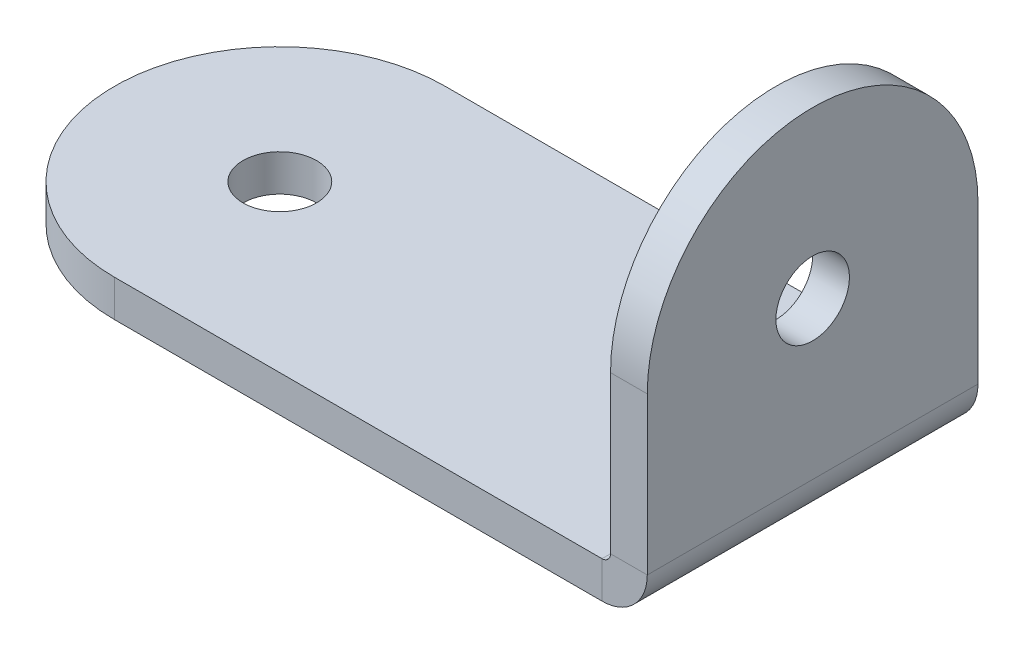
ISO-10303-21;
HEADER;
FILE_DESCRIPTION(('STEP AP214'),'2;1');
FILE_NAME('part.step','',(''),(''),'','','');
FILE_SCHEMA(('AUTOMOTIVE_DESIGN { 1 0 10303 214 1 1 1 1 }'));
ENDSEC;
DATA;
#1=APPLICATION_CONTEXT('core data for automotive mechanical design processes');
#2=APPLICATION_PROTOCOL_DEFINITION('international standard','automotive_design',2000,#1);
#3=PRODUCT_CONTEXT('',#1,'mechanical');
#4=PRODUCT('Part','Part','',(#3));
#5=PRODUCT_RELATED_PRODUCT_CATEGORY('part','',(#4));
#6=PRODUCT_DEFINITION_FORMATION('','',#4);
#7=PRODUCT_DEFINITION_CONTEXT('part definition',#1,'design');
#8=PRODUCT_DEFINITION('design','',#6,#7);
#9=PRODUCT_DEFINITION_SHAPE('','',#8);
#10=(LENGTH_UNIT() NAMED_UNIT(*) SI_UNIT(.MILLI.,.METRE.));
#11=(NAMED_UNIT(*) PLANE_ANGLE_UNIT() SI_UNIT($,.RADIAN.));
#12=(NAMED_UNIT(*) SI_UNIT($,.STERADIAN.) SOLID_ANGLE_UNIT());
#13=UNCERTAINTY_MEASURE_WITH_UNIT(LENGTH_MEASURE(1.E-05),#10,'distance_accuracy_value','');
#14=(GEOMETRIC_REPRESENTATION_CONTEXT(3) GLOBAL_UNCERTAINTY_ASSIGNED_CONTEXT((#13)) GLOBAL_UNIT_ASSIGNED_CONTEXT((#10,
#11,#12)) REPRESENTATION_CONTEXT('',''));
#15=CARTESIAN_POINT('',(0.,0.,0.));
#16=DIRECTION('',(0.,0.,1.));
#17=DIRECTION('',(1.,0.,0.));
#18=AXIS2_PLACEMENT_3D('',#15,#16,#17);
#19=CARTESIAN_POINT('',(3.175,14.2875,0.));
#20=DIRECTION('',(1.,0.,0.));
#21=DIRECTION('',(0.,0.,-1.));
#22=AXIS2_PLACEMENT_3D('',#19,#20,#21);
#23=CYLINDRICAL_SURFACE('',#22,14.2875);
#24=DIRECTION('',(1.,0.,0.));
#25=VECTOR('',#24,1.);
#26=CARTESIAN_POINT('',(-0.736599999999999,14.2875,14.2875));
#27=LINE('',#26,#25);
#28=CARTESIAN_POINT('',(3.175,14.2875,14.2875));
#29=VERTEX_POINT('',#28);
#30=CARTESIAN_POINT('',(0.,14.2875,14.2875));
#31=VERTEX_POINT('',#30);
#32=EDGE_CURVE('E182',#29,#31,#27,.F.);
#33=ORIENTED_EDGE('',*,*,#32,.F.);
#34=CARTESIAN_POINT('',(3.175,14.2875,0.));
#35=DIRECTION('',(1.,0.,0.));
#36=DIRECTION('',(0.,0.,-1.));
#37=AXIS2_PLACEMENT_3D('',#34,#35,#36);
#38=CIRCLE('',#37,14.2875);
#39=CARTESIAN_POINT('',(3.175,14.2875,-14.2875));
#40=VERTEX_POINT('',#39);
#41=EDGE_CURVE('E47',#40,#29,#38,.T.);
#42=ORIENTED_EDGE('',*,*,#41,.F.);
#43=DIRECTION('',(-1.,0.,0.));
#44=VECTOR('',#43,1.);
#45=CARTESIAN_POINT('',(3.175,14.2875,-14.2875));
#46=LINE('',#45,#44);
#47=CARTESIAN_POINT('',(0.,14.2875,-14.2875));
#48=VERTEX_POINT('',#47);
#49=EDGE_CURVE('E185',#48,#40,#46,.F.);
#50=ORIENTED_EDGE('',*,*,#49,.F.);
#51=CARTESIAN_POINT('',(0.,14.2875,0.));
#52=DIRECTION('',(1.,0.,0.));
#53=DIRECTION('',(0.,0.,-1.));
#54=AXIS2_PLACEMENT_3D('',#51,#52,#53);
#55=CIRCLE('',#54,14.2875);
#56=EDGE_CURVE('E11',#31,#48,#55,.F.);
#57=ORIENTED_EDGE('',*,*,#56,.F.);
#58=EDGE_LOOP('',(#33,#42,#50,#57));
#59=FACE_BOUND('',#58,.T.);
#60=ADVANCED_FACE('F39',(#59),#23,.T.);
#61=CARTESIAN_POINT('',(-42.8625,0.,0.));
#62=DIRECTION('',(0.,1.,0.));
#63=DIRECTION('',(0.,0.,1.));
#64=AXIS2_PLACEMENT_3D('',#61,#62,#63);
#65=CYLINDRICAL_SURFACE('',#64,14.2875);
#66=DIRECTION('',(0.,1.,0.));
#67=VECTOR('',#66,1.);
#68=CARTESIAN_POINT('',(-42.8625,0.7366,14.2875));
#69=LINE('',#68,#67);
#70=CARTESIAN_POINT('',(-42.8625,0.,14.2875));
#71=VERTEX_POINT('',#70);
#72=CARTESIAN_POINT('',(-42.8625,-3.17500000000001,14.2875));
#73=VERTEX_POINT('',#72);
#74=EDGE_CURVE('E134',#71,#73,#69,.F.);
#75=ORIENTED_EDGE('',*,*,#74,.F.);
#76=CARTESIAN_POINT('',(-42.8625,0.,0.));
#77=DIRECTION('',(0.,-1.,0.));
#78=DIRECTION('',(1.,0.,0.));
#79=AXIS2_PLACEMENT_3D('',#76,#77,#78);
#80=CIRCLE('',#79,14.2875);
#81=CARTESIAN_POINT('',(-42.8625,0.,-14.2875));
#82=VERTEX_POINT('',#81);
#83=EDGE_CURVE('E178',#82,#71,#80,.F.);
#84=ORIENTED_EDGE('',*,*,#83,.F.);
#85=DIRECTION('',(0.,1.,0.));
#86=VECTOR('',#85,1.);
#87=CARTESIAN_POINT('',(-42.8625,0.736600000000001,-14.2875));
#88=LINE('',#87,#86);
#89=CARTESIAN_POINT('',(-42.8625,-3.17500000000001,-14.2875));
#90=VERTEX_POINT('',#89);
#91=EDGE_CURVE('E175',#90,#82,#88,.T.);
#92=ORIENTED_EDGE('',*,*,#91,.F.);
#93=CARTESIAN_POINT('',(-42.8625,-3.17500000000001,0.));
#94=DIRECTION('',(0.,-1.,0.));
#95=DIRECTION('',(1.,0.,0.));
#96=AXIS2_PLACEMENT_3D('',#93,#94,#95);
#97=CIRCLE('',#96,14.2875);
#98=EDGE_CURVE('E180',#73,#90,#97,.T.);
#99=ORIENTED_EDGE('',*,*,#98,.F.);
#100=EDGE_LOOP('',(#75,#84,#92,#99));
#101=FACE_BOUND('',#100,.T.);
#102=ADVANCED_FACE('F232',(#101),#65,.T.);
#103=CARTESIAN_POINT('',(0.,0.7366,14.2875));
#104=DIRECTION('',(0.,0.,1.));
#105=DIRECTION('',(1.,0.,0.));
#106=AXIS2_PLACEMENT_3D('',#103,#104,#105);
#107=PLANE('',#106);
#108=DIRECTION('',(1.,0.,0.));
#109=VECTOR('',#108,1.);
#110=CARTESIAN_POINT('',(0.,0.7366,14.2875));
#111=LINE('',#110,#109);
#112=CARTESIAN_POINT('',(0.,0.7366,14.2875));
#113=VERTEX_POINT('',#112);
#114=CARTESIAN_POINT('',(3.175,0.736600000000001,14.2875));
#115=VERTEX_POINT('',#114);
#116=EDGE_CURVE('E113',#113,#115,#111,.T.);
#117=ORIENTED_EDGE('',*,*,#116,.F.);
#118=CARTESIAN_POINT('',(-0.7366,0.7366,14.2875));
#119=DIRECTION('',(0.,0.,1.));
#120=DIRECTION('',(1.,0.,0.));
#121=AXIS2_PLACEMENT_3D('',#118,#119,#120);
#122=CIRCLE('',#121,0.7366);
#123=CARTESIAN_POINT('',(-0.7366,0.,14.2875));
#124=VERTEX_POINT('',#123);
#125=EDGE_CURVE('E108',#113,#124,#122,.F.);
#126=ORIENTED_EDGE('',*,*,#125,.T.);
#127=DIRECTION('',(0.,1.,0.));
#128=VECTOR('',#127,1.);
#129=CARTESIAN_POINT('',(-0.736599999999999,-3.175,14.2875));
#130=LINE('',#129,#128);
#131=CARTESIAN_POINT('',(-0.736599999999999,-3.175,14.2875));
#132=VERTEX_POINT('',#131);
#133=EDGE_CURVE('E101',#132,#124,#130,.T.);
#134=ORIENTED_EDGE('',*,*,#133,.F.);
#135=CARTESIAN_POINT('',(-0.7366,0.7366,14.2875));
#136=DIRECTION('',(0.,0.,1.));
#137=DIRECTION('',(1.,0.,0.));
#138=AXIS2_PLACEMENT_3D('',#135,#136,#137);
#139=CIRCLE('',#138,3.9116);
#140=EDGE_CURVE('E106',#115,#132,#139,.F.);
#141=ORIENTED_EDGE('',*,*,#140,.F.);
#142=EDGE_LOOP('',(#117,#126,#134,#141));
#143=FACE_BOUND('',#142,.T.);
#144=ADVANCED_FACE('F104',(#143),#107,.T.);
#145=CARTESIAN_POINT('',(-0.736599999999999,-3.175,14.2875));
#146=DIRECTION('',(0.,0.,1.));
#147=DIRECTION('',(1.,0.,0.));
#148=AXIS2_PLACEMENT_3D('',#145,#146,#147);
#149=PLANE('',#148);
#150=DIRECTION('',(0.,1.,0.));
#151=VECTOR('',#150,1.);
#152=CARTESIAN_POINT('',(3.175,28.575,14.2875));
#153=LINE('',#152,#151);
#154=EDGE_CURVE('E140',#29,#115,#153,.F.);
#155=ORIENTED_EDGE('',*,*,#154,.F.);
#156=ORIENTED_EDGE('',*,*,#32,.T.);
#157=DIRECTION('',(0.,-1.,0.));
#158=VECTOR('',#157,1.);
#159=CARTESIAN_POINT('',(0.,28.575,14.2875));
#160=LINE('',#159,#158);
#161=EDGE_CURVE('E142',#31,#113,#160,.T.);
#162=ORIENTED_EDGE('',*,*,#161,.T.);
#163=ORIENTED_EDGE('',*,*,#116,.T.);
#164=EDGE_LOOP('',(#155,#156,#162,#163));
#165=FACE_BOUND('',#164,.T.);
#166=ADVANCED_FACE('F191',(#165),#149,.T.);
#167=CARTESIAN_POINT('',(-0.7366,0.,-14.2875));
#168=DIRECTION('',(0.,0.,-1.));
#169=DIRECTION('',(-1.,0.,0.));
#170=AXIS2_PLACEMENT_3D('',#167,#168,#169);
#171=PLANE('',#170);
#172=DIRECTION('',(0.,-1.,0.));
#173=VECTOR('',#172,1.);
#174=CARTESIAN_POINT('',(-0.7366,0.,-14.2875));
#175=LINE('',#174,#173);
#176=CARTESIAN_POINT('',(-0.7366,0.,-14.2875));
#177=VERTEX_POINT('',#176);
#178=CARTESIAN_POINT('',(-0.736599999999999,-3.175,-14.2875));
#179=VERTEX_POINT('',#178);
#180=EDGE_CURVE('E114',#177,#179,#175,.T.);
#181=ORIENTED_EDGE('',*,*,#180,.F.);
#182=CARTESIAN_POINT('',(-0.7366,0.7366,-14.2875));
#183=DIRECTION('',(0.,0.,1.));
#184=DIRECTION('',(1.,0.,0.));
#185=AXIS2_PLACEMENT_3D('',#182,#183,#184);
#186=CIRCLE('',#185,0.7366);
#187=CARTESIAN_POINT('',(0.,0.7366,-14.2875));
#188=VERTEX_POINT('',#187);
#189=EDGE_CURVE('E160',#188,#177,#186,.F.);
#190=ORIENTED_EDGE('',*,*,#189,.F.);
#191=DIRECTION('',(-1.,0.,0.));
#192=VECTOR('',#191,1.);
#193=CARTESIAN_POINT('',(3.175,0.736600000000001,-14.2875));
#194=LINE('',#193,#192);
#195=CARTESIAN_POINT('',(3.175,0.736600000000001,-14.2875));
#196=VERTEX_POINT('',#195);
#197=EDGE_CURVE('E128',#196,#188,#194,.T.);
#198=ORIENTED_EDGE('',*,*,#197,.F.);
#199=CARTESIAN_POINT('',(-0.7366,0.7366,-14.2875));
#200=DIRECTION('',(0.,0.,1.));
#201=DIRECTION('',(1.,0.,0.));
#202=AXIS2_PLACEMENT_3D('',#199,#200,#201);
#203=CIRCLE('',#202,3.9116);
#204=EDGE_CURVE('E154',#196,#179,#203,.F.);
#205=ORIENTED_EDGE('',*,*,#204,.T.);
#206=EDGE_LOOP('',(#181,#190,#198,#205));
#207=FACE_BOUND('',#206,.T.);
#208=ADVANCED_FACE('F247',(#207),#171,.T.);
#209=CARTESIAN_POINT('',(3.175,0.736600000000001,-14.2875));
#210=DIRECTION('',(0.,0.,-1.));
#211=DIRECTION('',(-1.,0.,0.));
#212=AXIS2_PLACEMENT_3D('',#209,#210,#211);
#213=PLANE('',#212);
#214=DIRECTION('',(-1.,0.,0.));
#215=VECTOR('',#214,1.);
#216=CARTESIAN_POINT('',(0.,-3.175,-14.2875));
#217=LINE('',#216,#215);
#218=EDGE_CURVE('E124',#179,#90,#217,.T.);
#219=ORIENTED_EDGE('',*,*,#218,.T.);
#220=ORIENTED_EDGE('',*,*,#91,.T.);
#221=DIRECTION('',(-1.,0.,0.));
#222=VECTOR('',#221,1.);
#223=CARTESIAN_POINT('',(0.,0.,-14.2875));
#224=LINE('',#223,#222);
#225=EDGE_CURVE('E149',#177,#82,#224,.T.);
#226=ORIENTED_EDGE('',*,*,#225,.F.);
#227=ORIENTED_EDGE('',*,*,#180,.T.);
#228=EDGE_LOOP('',(#219,#220,#226,#227));
#229=FACE_BOUND('',#228,.T.);
#230=ADVANCED_FACE('F250',(#229),#213,.T.);
#231=CARTESIAN_POINT('',(0.,0.,14.2875));
#232=DIRECTION('',(0.,-1.,0.));
#233=DIRECTION('',(1.,0.,0.));
#234=AXIS2_PLACEMENT_3D('',#231,#232,#233);
#235=PLANE('',#234);
#236=CARTESIAN_POINT('',(-42.8625,0.,0.));
#237=DIRECTION('',(0.,1.,0.));
#238=DIRECTION('',(-1.,0.,0.));
#239=AXIS2_PLACEMENT_3D('',#236,#237,#238);
#240=CIRCLE('',#239,3.175);
#241=CARTESIAN_POINT('',(-46.0375,0.,0.));
#242=VERTEX_POINT('',#241);
#243=EDGE_CURVE('E203',#242,#242,#240,.T.);
#244=ORIENTED_EDGE('',*,*,#243,.F.);
#245=EDGE_LOOP('',(#244));
#246=FACE_BOUND('',#245,.T.);
#247=ORIENTED_EDGE('',*,*,#225,.T.);
#248=ORIENTED_EDGE('',*,*,#83,.T.);
#249=DIRECTION('',(-1.,0.,0.));
#250=VECTOR('',#249,1.);
#251=CARTESIAN_POINT('',(0.,0.,14.2875));
#252=LINE('',#251,#250);
#253=EDGE_CURVE('E135',#124,#71,#252,.T.);
#254=ORIENTED_EDGE('',*,*,#253,.F.);
#255=DIRECTION('',(0.,0.,-1.));
#256=VECTOR('',#255,1.);
#257=CARTESIAN_POINT('',(-0.7366,0.,14.2875));
#258=LINE('',#257,#256);
#259=EDGE_CURVE('E148',#124,#177,#258,.T.);
#260=ORIENTED_EDGE('',*,*,#259,.T.);
#261=EDGE_LOOP('',(#247,#248,#254,#260));
#262=FACE_BOUND('',#261,.T.);
#263=ADVANCED_FACE('F201',(#246,#262),#235,.F.);
#264=CARTESIAN_POINT('',(0.,-3.175,14.2875));
#265=DIRECTION('',(0.,-1.,0.));
#266=DIRECTION('',(1.,0.,0.));
#267=AXIS2_PLACEMENT_3D('',#264,#265,#266);
#268=PLANE('',#267);
#269=CARTESIAN_POINT('',(-42.8625,-3.17500000000001,0.));
#270=DIRECTION('',(0.,1.,0.));
#271=DIRECTION('',(-1.,0.,0.));
#272=AXIS2_PLACEMENT_3D('',#269,#270,#271);
#273=CIRCLE('',#272,3.175);
#274=CARTESIAN_POINT('',(-46.0375,-3.17500000000001,0.));
#275=VERTEX_POINT('',#274);
#276=EDGE_CURVE('E152',#275,#275,#273,.T.);
#277=ORIENTED_EDGE('',*,*,#276,.T.);
#278=EDGE_LOOP('',(#277));
#279=FACE_BOUND('',#278,.T.);
#280=DIRECTION('',(-1.,0.,0.));
#281=VECTOR('',#280,1.);
#282=CARTESIAN_POINT('',(0.,-3.175,14.2875));
#283=LINE('',#282,#281);
#284=EDGE_CURVE('E122',#132,#73,#283,.T.);
#285=ORIENTED_EDGE('',*,*,#284,.T.);
#286=ORIENTED_EDGE('',*,*,#98,.T.);
#287=ORIENTED_EDGE('',*,*,#218,.F.);
#288=DIRECTION('',(0.,0.,-1.));
#289=VECTOR('',#288,1.);
#290=CARTESIAN_POINT('',(-0.736599999999999,-3.175,14.2875));
#291=LINE('',#290,#289);
#292=EDGE_CURVE('E120',#132,#179,#291,.T.);
#293=ORIENTED_EDGE('',*,*,#292,.F.);
#294=EDGE_LOOP('',(#285,#286,#287,#293));
#295=FACE_BOUND('',#294,.T.);
#296=ADVANCED_FACE('F121',(#279,#295),#268,.T.);
#297=CARTESIAN_POINT('',(-0.7366,0.7366,14.2875));
#298=DIRECTION('',(0.,0.,-1.));
#299=DIRECTION('',(-1.,0.,0.));
#300=AXIS2_PLACEMENT_3D('',#297,#298,#299);
#301=CYLINDRICAL_SURFACE('',#300,3.9116);
#302=ORIENTED_EDGE('',*,*,#204,.F.);
#303=DIRECTION('',(0.,0.,-1.));
#304=VECTOR('',#303,1.);
#305=CARTESIAN_POINT('',(3.175,0.736600000000001,14.2875));
#306=LINE('',#305,#304);
#307=EDGE_CURVE('E129',#115,#196,#306,.T.);
#308=ORIENTED_EDGE('',*,*,#307,.F.);
#309=ORIENTED_EDGE('',*,*,#140,.T.);
#310=ORIENTED_EDGE('',*,*,#292,.T.);
#311=EDGE_LOOP('',(#302,#308,#309,#310));
#312=FACE_BOUND('',#311,.T.);
#313=ADVANCED_FACE('F138',(#312),#301,.T.);
#314=CARTESIAN_POINT('',(3.175,28.575,14.2875));
#315=DIRECTION('',(1.,0.,0.));
#316=DIRECTION('',(0.,0.,-1.));
#317=AXIS2_PLACEMENT_3D('',#314,#315,#316);
#318=PLANE('',#317);
#319=CARTESIAN_POINT('',(3.175,14.2875,0.));
#320=DIRECTION('',(-1.,0.,0.));
#321=DIRECTION('',(0.,0.,1.));
#322=AXIS2_PLACEMENT_3D('',#319,#320,#321);
#323=CIRCLE('',#322,3.175);
#324=CARTESIAN_POINT('',(3.175,14.2875,3.175));
#325=VERTEX_POINT('',#324);
#326=EDGE_CURVE('E206',#325,#325,#323,.T.);
#327=ORIENTED_EDGE('',*,*,#326,.T.);
#328=EDGE_LOOP('',(#327));
#329=FACE_BOUND('',#328,.T.);
#330=DIRECTION('',(0.,1.,0.));
#331=VECTOR('',#330,1.);
#332=CARTESIAN_POINT('',(3.175,28.575,-14.2875));
#333=LINE('',#332,#331);
#334=EDGE_CURVE('E156',#40,#196,#333,.F.);
#335=ORIENTED_EDGE('',*,*,#334,.F.);
#336=ORIENTED_EDGE('',*,*,#41,.T.);
#337=ORIENTED_EDGE('',*,*,#154,.T.);
#338=ORIENTED_EDGE('',*,*,#307,.T.);
#339=EDGE_LOOP('',(#335,#336,#337,#338));
#340=FACE_BOUND('',#339,.T.);
#341=ADVANCED_FACE('F188',(#329,#340),#318,.T.);
#342=CARTESIAN_POINT('',(0.,28.575,14.2875));
#343=DIRECTION('',(1.,0.,0.));
#344=DIRECTION('',(0.,0.,-1.));
#345=AXIS2_PLACEMENT_3D('',#342,#343,#344);
#346=PLANE('',#345);
#347=CARTESIAN_POINT('',(0.,14.2875,0.));
#348=DIRECTION('',(-1.,0.,0.));
#349=DIRECTION('',(0.,0.,1.));
#350=AXIS2_PLACEMENT_3D('',#347,#348,#349);
#351=CIRCLE('',#350,3.175);
#352=CARTESIAN_POINT('',(0.,14.2875,3.175));
#353=VERTEX_POINT('',#352);
#354=EDGE_CURVE('E209',#353,#353,#351,.T.);
#355=ORIENTED_EDGE('',*,*,#354,.F.);
#356=EDGE_LOOP('',(#355));
#357=FACE_BOUND('',#356,.T.);
#358=ORIENTED_EDGE('',*,*,#161,.F.);
#359=ORIENTED_EDGE('',*,*,#56,.T.);
#360=DIRECTION('',(0.,-1.,0.));
#361=VECTOR('',#360,1.);
#362=CARTESIAN_POINT('',(0.,28.575,-14.2875));
#363=LINE('',#362,#361);
#364=EDGE_CURVE('E158',#48,#188,#363,.T.);
#365=ORIENTED_EDGE('',*,*,#364,.T.);
#366=DIRECTION('',(0.,0.,-1.));
#367=VECTOR('',#366,1.);
#368=CARTESIAN_POINT('',(0.,0.7366,14.2875));
#369=LINE('',#368,#367);
#370=EDGE_CURVE('E165',#113,#188,#369,.T.);
#371=ORIENTED_EDGE('',*,*,#370,.F.);
#372=EDGE_LOOP('',(#358,#359,#365,#371));
#373=FACE_BOUND('',#372,.T.);
#374=ADVANCED_FACE('F193',(#357,#373),#346,.F.);
#375=CARTESIAN_POINT('',(-0.7366,0.7366,14.2875));
#376=DIRECTION('',(0.,0.,-1.));
#377=DIRECTION('',(-1.,0.,0.));
#378=AXIS2_PLACEMENT_3D('',#375,#376,#377);
#379=CYLINDRICAL_SURFACE('',#378,0.7366);
#380=ORIENTED_EDGE('',*,*,#189,.T.);
#381=ORIENTED_EDGE('',*,*,#259,.F.);
#382=ORIENTED_EDGE('',*,*,#125,.F.);
#383=ORIENTED_EDGE('',*,*,#370,.T.);
#384=EDGE_LOOP('',(#380,#381,#382,#383));
#385=FACE_BOUND('',#384,.T.);
#386=ADVANCED_FACE('F197',(#385),#379,.F.);
#387=CARTESIAN_POINT('',(-0.7366,0.7366,14.2875));
#388=DIRECTION('',(0.,0.,1.));
#389=DIRECTION('',(1.,0.,0.));
#390=AXIS2_PLACEMENT_3D('',#387,#388,#389);
#391=PLANE('',#390);
#392=ORIENTED_EDGE('',*,*,#253,.T.);
#393=ORIENTED_EDGE('',*,*,#74,.T.);
#394=ORIENTED_EDGE('',*,*,#284,.F.);
#395=ORIENTED_EDGE('',*,*,#133,.T.);
#396=EDGE_LOOP('',(#392,#393,#394,#395));
#397=FACE_BOUND('',#396,.T.);
#398=ADVANCED_FACE('F132',(#397),#391,.T.);
#399=CARTESIAN_POINT('',(-0.7366,0.7366,-14.2875));
#400=DIRECTION('',(0.,0.,1.));
#401=DIRECTION('',(1.,0.,0.));
#402=AXIS2_PLACEMENT_3D('',#399,#400,#401);
#403=PLANE('',#402);
#404=ORIENTED_EDGE('',*,*,#364,.F.);
#405=ORIENTED_EDGE('',*,*,#49,.T.);
#406=ORIENTED_EDGE('',*,*,#334,.T.);
#407=ORIENTED_EDGE('',*,*,#197,.T.);
#408=EDGE_LOOP('',(#404,#405,#406,#407));
#409=FACE_BOUND('',#408,.T.);
#410=ADVANCED_FACE('F287',(#409),#403,.F.);
#411=CARTESIAN_POINT('',(-42.8625,-3.17500000000001,0.));
#412=DIRECTION('',(0.,1.,0.));
#413=DIRECTION('',(-1.,0.,0.));
#414=AXIS2_PLACEMENT_3D('',#411,#412,#413);
#415=CYLINDRICAL_SURFACE('',#414,3.175);
#416=ORIENTED_EDGE('',*,*,#276,.F.);
#417=EDGE_LOOP('',(#416));
#418=FACE_BOUND('',#417,.T.);
#419=ORIENTED_EDGE('',*,*,#243,.T.);
#420=EDGE_LOOP('',(#419));
#421=FACE_BOUND('',#420,.T.);
#422=ADVANCED_FACE('F219',(#418,#421),#415,.F.);
#423=CARTESIAN_POINT('',(3.175,14.2875,0.));
#424=DIRECTION('',(-1.,0.,0.));
#425=DIRECTION('',(0.,0.,1.));
#426=AXIS2_PLACEMENT_3D('',#423,#424,#425);
#427=CYLINDRICAL_SURFACE('',#426,3.175);
#428=ORIENTED_EDGE('',*,*,#326,.F.);
#429=EDGE_LOOP('',(#428));
#430=FACE_BOUND('',#429,.T.);
#431=ORIENTED_EDGE('',*,*,#354,.T.);
#432=EDGE_LOOP('',(#431));
#433=FACE_BOUND('',#432,.T.);
#434=ADVANCED_FACE('F216',(#430,#433),#427,.F.);
#435=CLOSED_SHELL('',(#60,#102,#144,#166,#208,#230,#263,#296,#313,#341,#374,#386,#398,#410,#422,#434));
#436=MANIFOLD_SOLID_BREP('B2',#435);
#437=ADVANCED_BREP_SHAPE_REPRESENTATION('',(#18,#436),#14);
#438=SHAPE_DEFINITION_REPRESENTATION(#9,#437);
ENDSEC;
END-ISO-10303-21;
